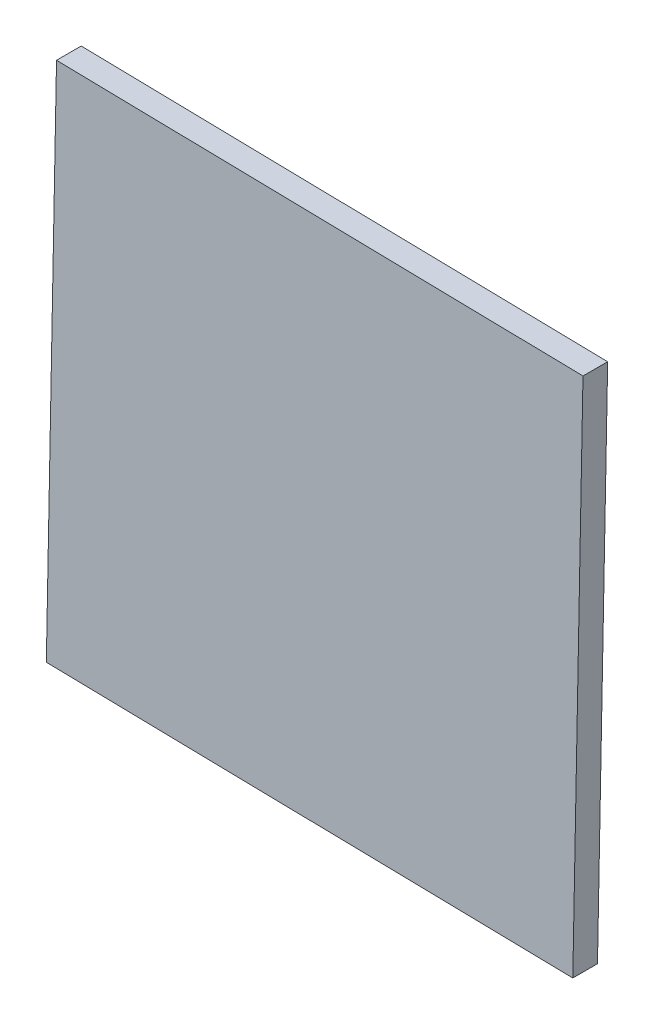
ISO-10303-21;
HEADER;
FILE_DESCRIPTION(('STEP AP214'),'2;1');
FILE_NAME('part.step','',(''),(''),'','','');
FILE_SCHEMA(('AUTOMOTIVE_DESIGN { 1 0 10303 214 1 1 1 1 }'));
ENDSEC;
DATA;
#1=APPLICATION_CONTEXT('core data for automotive mechanical design processes');
#2=APPLICATION_PROTOCOL_DEFINITION('international standard','automotive_design',2000,#1);
#3=PRODUCT_CONTEXT('',#1,'mechanical');
#4=PRODUCT('Part','Part','',(#3));
#5=PRODUCT_RELATED_PRODUCT_CATEGORY('part','',(#4));
#6=PRODUCT_DEFINITION_FORMATION('','',#4);
#7=PRODUCT_DEFINITION_CONTEXT('part definition',#1,'design');
#8=PRODUCT_DEFINITION('design','',#6,#7);
#9=PRODUCT_DEFINITION_SHAPE('','',#8);
#10=(LENGTH_UNIT() NAMED_UNIT(*) SI_UNIT(.MILLI.,.METRE.));
#11=(NAMED_UNIT(*) PLANE_ANGLE_UNIT() SI_UNIT($,.RADIAN.));
#12=(NAMED_UNIT(*) SI_UNIT($,.STERADIAN.) SOLID_ANGLE_UNIT());
#13=UNCERTAINTY_MEASURE_WITH_UNIT(LENGTH_MEASURE(1.E-05),#10,'distance_accuracy_value','');
#14=(GEOMETRIC_REPRESENTATION_CONTEXT(3) GLOBAL_UNCERTAINTY_ASSIGNED_CONTEXT((#13)) GLOBAL_UNIT_ASSIGNED_CONTEXT((#10,
#11,#12)) REPRESENTATION_CONTEXT('',''));
#15=CARTESIAN_POINT('',(0.,0.,0.));
#16=DIRECTION('',(0.,0.,1.));
#17=DIRECTION('',(1.,0.,0.));
#18=AXIS2_PLACEMENT_3D('',#15,#16,#17);
#19=CARTESIAN_POINT('',(-1.66355339164993,3.30225427634785,43.6520965279299));
#20=DIRECTION('',(0.,0.,-1.));
#21=DIRECTION('',(-0.999812677663925,0.0193548335692301,0.));
#22=AXIS2_PLACEMENT_3D('',#19,#20,#21);
#23=PLANE('',#22);
#24=DIRECTION('',(-0.999812677663925,0.0193548335692301,0.));
#25=VECTOR('',#24,1.);
#26=CARTESIAN_POINT('',(6.30560796515175,-4.98153925495523,43.6520965279302));
#27=LINE('',#26,#25);
#28=CARTESIAN_POINT('',(6.30560796515175,-4.98153925495523,43.6520965279302));
#29=VERTEX_POINT('',#28);
#30=CARTESIAN_POINT('',(-9.94734692295302,-4.66690708045383,43.6520965279297));
#31=VERTEX_POINT('',#30);
#32=EDGE_CURVE('E59',#29,#31,#27,.T.);
#33=ORIENTED_EDGE('',*,*,#32,.T.);
#34=DIRECTION('',(0.0193548335692301,0.999812677663925,0.));
#35=VECTOR('',#34,1.);
#36=CARTESIAN_POINT('',(-9.94734692295302,-4.66690708045383,43.6520965279297));
#37=LINE('',#36,#35);
#38=CARTESIAN_POINT('',(-9.63271474845161,11.5860478076509,43.6520965279295));
#39=VERTEX_POINT('',#38);
#40=EDGE_CURVE('E20',#31,#39,#37,.T.);
#41=ORIENTED_EDGE('',*,*,#40,.T.);
#42=DIRECTION('',(0.999812677663925,-0.0193548335692301,0.));
#43=VECTOR('',#42,1.);
#44=CARTESIAN_POINT('',(6.62024013965315,11.2714156331495,43.65209652793));
#45=LINE('',#44,#43);
#46=CARTESIAN_POINT('',(6.62024013965315,11.2714156331495,43.65209652793));
#47=VERTEX_POINT('',#46);
#48=EDGE_CURVE('E56',#39,#47,#45,.T.);
#49=ORIENTED_EDGE('',*,*,#48,.T.);
#50=DIRECTION('',(-0.0193548335692301,-0.999812677663925,0.));
#51=VECTOR('',#50,1.);
#52=CARTESIAN_POINT('',(6.30560796515175,-4.98153925495523,43.6520965279302));
#53=LINE('',#52,#51);
#54=EDGE_CURVE('E83',#47,#29,#53,.T.);
#55=ORIENTED_EDGE('',*,*,#54,.T.);
#56=EDGE_LOOP('',(#33,#41,#49,#55));
#57=FACE_BOUND('',#56,.T.);
#58=ADVANCED_FACE('F17',(#57),#23,.T.);
#59=CARTESIAN_POINT('',(-9.94734692295304,-4.66690708045382,44.4140965279297));
#60=DIRECTION('',(0.999812677663925,-0.0193548335692301,0.));
#61=DIRECTION('',(0.0193548335692301,0.999812677663925,0.));
#62=AXIS2_PLACEMENT_3D('',#59,#60,#61);
#63=PLANE('',#62);
#64=DIRECTION('',(0.,0.,1.));
#65=VECTOR('',#64,1.);
#66=CARTESIAN_POINT('',(-9.63271474845164,11.5860478076509,44.4140965279295));
#67=LINE('',#66,#65);
#68=CARTESIAN_POINT('',(-9.63271474845164,11.5860478076509,44.4140965279295));
#69=VERTEX_POINT('',#68);
#70=EDGE_CURVE('E65',#69,#39,#67,.F.);
#71=ORIENTED_EDGE('',*,*,#70,.T.);
#72=ORIENTED_EDGE('',*,*,#40,.F.);
#73=DIRECTION('',(0.,0.,1.));
#74=VECTOR('',#73,1.);
#75=CARTESIAN_POINT('',(-9.94734692295304,-4.66690708045382,44.4140965279297));
#76=LINE('',#75,#74);
#77=CARTESIAN_POINT('',(-9.94734692295304,-4.66690708045382,44.4140965279297));
#78=VERTEX_POINT('',#77);
#79=EDGE_CURVE('E89',#31,#78,#76,.T.);
#80=ORIENTED_EDGE('',*,*,#79,.T.);
#81=DIRECTION('',(0.0193548335692301,0.999812677663925,0.));
#82=VECTOR('',#81,1.);
#83=CARTESIAN_POINT('',(-9.79003083570234,3.45957036359857,44.4140965279295));
#84=LINE('',#83,#82);
#85=EDGE_CURVE('E76',#78,#69,#84,.T.);
#86=ORIENTED_EDGE('',*,*,#85,.T.);
#87=EDGE_LOOP('',(#71,#72,#80,#86));
#88=FACE_BOUND('',#87,.T.);
#89=ADVANCED_FACE('F75',(#88),#63,.F.);
#90=CARTESIAN_POINT('',(6.62024013965313,11.2714156331495,44.41409652793));
#91=DIRECTION('',(-0.0193548335692301,-0.999812677663925,0.));
#92=DIRECTION('',(0.999812677663925,-0.0193548335692301,0.));
#93=AXIS2_PLACEMENT_3D('',#90,#91,#92);
#94=PLANE('',#93);
#95=DIRECTION('',(0.,0.,1.));
#96=VECTOR('',#95,1.);
#97=CARTESIAN_POINT('',(6.62024013965313,11.2714156331495,44.41409652793));
#98=LINE('',#97,#96);
#99=CARTESIAN_POINT('',(6.62024013965313,11.2714156331495,44.41409652793));
#100=VERTEX_POINT('',#99);
#101=EDGE_CURVE('E71',#100,#47,#98,.F.);
#102=ORIENTED_EDGE('',*,*,#101,.T.);
#103=ORIENTED_EDGE('',*,*,#48,.F.);
#104=ORIENTED_EDGE('',*,*,#70,.F.);
#105=DIRECTION('',(-0.999812677663925,0.0193548335692301,0.));
#106=VECTOR('',#105,1.);
#107=CARTESIAN_POINT('',(-1.50623730439925,11.4287317204002,44.4140965279297));
#108=LINE('',#107,#106);
#109=EDGE_CURVE('E94',#69,#100,#108,.F.);
#110=ORIENTED_EDGE('',*,*,#109,.T.);
#111=EDGE_LOOP('',(#102,#103,#104,#110));
#112=FACE_BOUND('',#111,.T.);
#113=ADVANCED_FACE('F68',(#112),#94,.F.);
#114=CARTESIAN_POINT('',(6.30560796515172,-4.98153925495522,44.4140965279302));
#115=DIRECTION('',(-0.999812677663925,0.0193548335692301,0.));
#116=DIRECTION('',(-0.0193548335692301,-0.999812677663925,0.));
#117=AXIS2_PLACEMENT_3D('',#114,#115,#116);
#118=PLANE('',#117);
#119=DIRECTION('',(0.,0.,1.));
#120=VECTOR('',#119,1.);
#121=CARTESIAN_POINT('',(6.30560796515172,-4.98153925495522,44.4140965279302));
#122=LINE('',#121,#120);
#123=CARTESIAN_POINT('',(6.30560796515172,-4.98153925495522,44.4140965279302));
#124=VERTEX_POINT('',#123);
#125=EDGE_CURVE('E35',#124,#29,#122,.F.);
#126=ORIENTED_EDGE('',*,*,#125,.T.);
#127=ORIENTED_EDGE('',*,*,#54,.F.);
#128=ORIENTED_EDGE('',*,*,#101,.F.);
#129=DIRECTION('',(0.0193548335692301,0.999812677663925,0.));
#130=VECTOR('',#129,1.);
#131=CARTESIAN_POINT('',(6.46292405240242,3.14493818909716,44.4140965279301));
#132=LINE('',#131,#130);
#133=EDGE_CURVE('E27',#100,#124,#132,.F.);
#134=ORIENTED_EDGE('',*,*,#133,.T.);
#135=EDGE_LOOP('',(#126,#127,#128,#134));
#136=FACE_BOUND('',#135,.T.);
#137=ADVANCED_FACE('F101',(#136),#118,.F.);
#138=CARTESIAN_POINT('',(6.30560796515172,-4.98153925495522,44.4140965279302));
#139=DIRECTION('',(0.0193548335692301,0.999812677663925,0.));
#140=DIRECTION('',(-0.999812677663925,0.0193548335692301,0.));
#141=AXIS2_PLACEMENT_3D('',#138,#139,#140);
#142=PLANE('',#141);
#143=ORIENTED_EDGE('',*,*,#79,.F.);
#144=ORIENTED_EDGE('',*,*,#32,.F.);
#145=ORIENTED_EDGE('',*,*,#125,.F.);
#146=DIRECTION('',(-0.999812677663925,0.0193548335692301,0.));
#147=VECTOR('',#146,1.);
#148=CARTESIAN_POINT('',(-1.82086947890066,-4.82422316770452,44.4140965279299));
#149=LINE('',#148,#147);
#150=EDGE_CURVE('E11',#124,#78,#149,.T.);
#151=ORIENTED_EDGE('',*,*,#150,.T.);
#152=EDGE_LOOP('',(#143,#144,#145,#151));
#153=FACE_BOUND('',#152,.T.);
#154=ADVANCED_FACE('F104',(#153),#142,.F.);
#155=CARTESIAN_POINT('',(-1.66355339164995,3.30225427634787,44.4140965279298));
#156=DIRECTION('',(0.,0.,-1.));
#157=DIRECTION('',(-0.999812677663925,0.0193548335692301,0.));
#158=AXIS2_PLACEMENT_3D('',#155,#156,#157);
#159=PLANE('',#158);
#160=ORIENTED_EDGE('',*,*,#133,.F.);
#161=ORIENTED_EDGE('',*,*,#109,.F.);
#162=ORIENTED_EDGE('',*,*,#85,.F.);
#163=ORIENTED_EDGE('',*,*,#150,.F.);
#164=EDGE_LOOP('',(#160,#161,#162,#163));
#165=FACE_BOUND('',#164,.T.);
#166=ADVANCED_FACE('F103',(#165),#159,.F.);
#167=CLOSED_SHELL('',(#58,#89,#113,#137,#154,#166));
#168=MANIFOLD_SOLID_BREP('B1',#167);
#169=ADVANCED_BREP_SHAPE_REPRESENTATION('',(#18,#168),#14);
#170=SHAPE_DEFINITION_REPRESENTATION(#9,#169);
ENDSEC;
END-ISO-10303-21;
